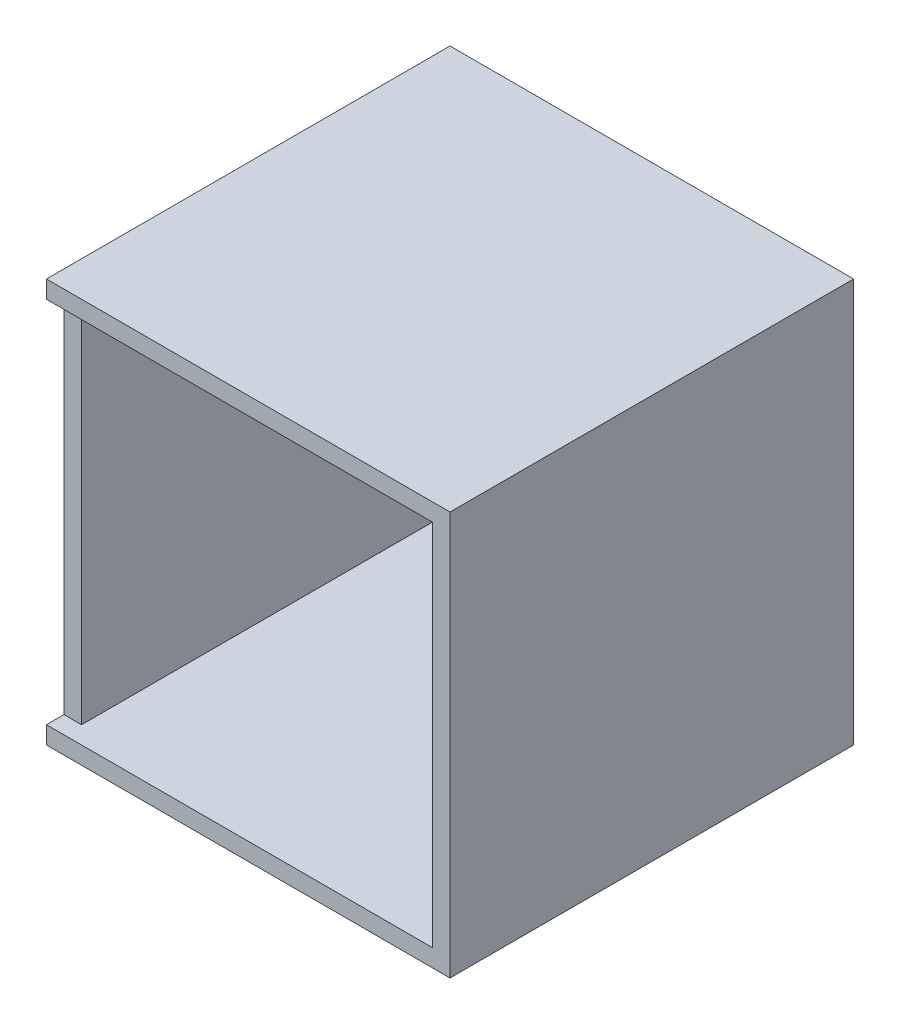
ISO-10303-21;
HEADER;
FILE_DESCRIPTION(('STEP AP214'),'2;1');
FILE_NAME('part.step','',(''),(''),'','','');
FILE_SCHEMA(('AUTOMOTIVE_DESIGN { 1 0 10303 214 1 1 1 1 }'));
ENDSEC;
DATA;
#1=APPLICATION_CONTEXT('core data for automotive mechanical design processes');
#2=APPLICATION_PROTOCOL_DEFINITION('international standard','automotive_design',2000,#1);
#3=PRODUCT_CONTEXT('',#1,'mechanical');
#4=PRODUCT('Part','Part','',(#3));
#5=PRODUCT_RELATED_PRODUCT_CATEGORY('part','',(#4));
#6=PRODUCT_DEFINITION_FORMATION('','',#4);
#7=PRODUCT_DEFINITION_CONTEXT('part definition',#1,'design');
#8=PRODUCT_DEFINITION('design','',#6,#7);
#9=PRODUCT_DEFINITION_SHAPE('','',#8);
#10=(LENGTH_UNIT() NAMED_UNIT(*) SI_UNIT(.MILLI.,.METRE.));
#11=(NAMED_UNIT(*) PLANE_ANGLE_UNIT() SI_UNIT($,.RADIAN.));
#12=(NAMED_UNIT(*) SI_UNIT($,.STERADIAN.) SOLID_ANGLE_UNIT());
#13=UNCERTAINTY_MEASURE_WITH_UNIT(LENGTH_MEASURE(1.E-05),#10,'distance_accuracy_value','');
#14=(GEOMETRIC_REPRESENTATION_CONTEXT(3) GLOBAL_UNCERTAINTY_ASSIGNED_CONTEXT((#13)) GLOBAL_UNIT_ASSIGNED_CONTEXT((#10,
#11,#12)) REPRESENTATION_CONTEXT('',''));
#15=CARTESIAN_POINT('',(0.,0.,0.));
#16=DIRECTION('',(0.,0.,1.));
#17=DIRECTION('',(1.,0.,0.));
#18=AXIS2_PLACEMENT_3D('',#15,#16,#17);
#19=CARTESIAN_POINT('',(146.05,146.05,146.05));
#20=DIRECTION('',(-1.,0.,0.));
#21=DIRECTION('',(0.,-1.,0.));
#22=AXIS2_PLACEMENT_3D('',#19,#20,#21);
#23=PLANE('',#22);
#24=DIRECTION('',(0.,1.,0.));
#25=VECTOR('',#24,1.);
#26=CARTESIAN_POINT('',(146.05,146.05,-146.05));
#27=LINE('',#26,#25);
#28=CARTESIAN_POINT('',(146.05,-146.05,-146.05));
#29=VERTEX_POINT('',#28);
#30=CARTESIAN_POINT('',(146.05,146.05,-146.05));
#31=VERTEX_POINT('',#30);
#32=EDGE_CURVE('E219',#29,#31,#27,.T.);
#33=ORIENTED_EDGE('',*,*,#32,.T.);
#34=DIRECTION('',(0.,0.,-1.));
#35=VECTOR('',#34,1.);
#36=CARTESIAN_POINT('',(146.05,146.05,146.05));
#37=LINE('',#36,#35);
#38=CARTESIAN_POINT('',(146.05,146.05,146.05));
#39=VERTEX_POINT('',#38);
#40=EDGE_CURVE('E11',#39,#31,#37,.T.);
#41=ORIENTED_EDGE('',*,*,#40,.F.);
#42=DIRECTION('',(0.,1.,0.));
#43=VECTOR('',#42,1.);
#44=CARTESIAN_POINT('',(146.05,146.05,146.05));
#45=LINE('',#44,#43);
#46=CARTESIAN_POINT('',(146.05,-146.05,146.05));
#47=VERTEX_POINT('',#46);
#48=EDGE_CURVE('E249',#47,#39,#45,.T.);
#49=ORIENTED_EDGE('',*,*,#48,.F.);
#50=DIRECTION('',(0.,0.,-1.));
#51=VECTOR('',#50,1.);
#52=CARTESIAN_POINT('',(146.05,-146.05,146.05));
#53=LINE('',#52,#51);
#54=EDGE_CURVE('E265',#47,#29,#53,.T.);
#55=ORIENTED_EDGE('',*,*,#54,.T.);
#56=EDGE_LOOP('',(#33,#41,#49,#55));
#57=FACE_BOUND('',#56,.T.);
#58=ADVANCED_FACE('F38',(#57),#23,.F.);
#59=CARTESIAN_POINT('',(-146.05,146.05,146.05));
#60=DIRECTION('',(0.,-1.,0.));
#61=DIRECTION('',(0.,0.,-1.));
#62=AXIS2_PLACEMENT_3D('',#59,#60,#61);
#63=PLANE('',#62);
#64=DIRECTION('',(-1.,0.,0.));
#65=VECTOR('',#64,1.);
#66=CARTESIAN_POINT('',(-146.05,146.05,-146.05));
#67=LINE('',#66,#65);
#68=CARTESIAN_POINT('',(-146.05,146.05,-146.05));
#69=VERTEX_POINT('',#68);
#70=EDGE_CURVE('E269',#31,#69,#67,.T.);
#71=ORIENTED_EDGE('',*,*,#70,.T.);
#72=DIRECTION('',(0.,0.,-1.));
#73=VECTOR('',#72,1.);
#74=CARTESIAN_POINT('',(-146.05,146.05,146.05));
#75=LINE('',#74,#73);
#76=CARTESIAN_POINT('',(-146.05,146.05,146.05));
#77=VERTEX_POINT('',#76);
#78=EDGE_CURVE('E46',#77,#69,#75,.T.);
#79=ORIENTED_EDGE('',*,*,#78,.F.);
#80=DIRECTION('',(-1.,0.,0.));
#81=VECTOR('',#80,1.);
#82=CARTESIAN_POINT('',(-146.05,146.05,146.05));
#83=LINE('',#82,#81);
#84=EDGE_CURVE('E253',#39,#77,#83,.T.);
#85=ORIENTED_EDGE('',*,*,#84,.F.);
#86=ORIENTED_EDGE('',*,*,#40,.T.);
#87=EDGE_LOOP('',(#71,#79,#85,#86));
#88=FACE_BOUND('',#87,.T.);
#89=ADVANCED_FACE('F340',(#88),#63,.F.);
#90=CARTESIAN_POINT('',(-146.05,146.05,146.05));
#91=DIRECTION('',(1.,0.,0.));
#92=DIRECTION('',(0.,1.,0.));
#93=AXIS2_PLACEMENT_3D('',#90,#91,#92);
#94=PLANE('',#93);
#95=DIRECTION('',(0.,1.,0.));
#96=VECTOR('',#95,1.);
#97=CARTESIAN_POINT('',(-146.05,146.05,133.35));
#98=LINE('',#97,#96);
#99=CARTESIAN_POINT('',(-146.05,-133.35,133.35));
#100=VERTEX_POINT('',#99);
#101=CARTESIAN_POINT('',(-146.05,133.35,133.35));
#102=VERTEX_POINT('',#101);
#103=EDGE_CURVE('E198',#100,#102,#98,.T.);
#104=ORIENTED_EDGE('',*,*,#103,.T.);
#105=DIRECTION('',(0.,0.,1.));
#106=VECTOR('',#105,1.);
#107=CARTESIAN_POINT('',(-146.05,133.35,146.05));
#108=LINE('',#107,#106);
#109=CARTESIAN_POINT('',(-146.05,133.35,146.05));
#110=VERTEX_POINT('',#109);
#111=EDGE_CURVE('E206',#102,#110,#108,.T.);
#112=ORIENTED_EDGE('',*,*,#111,.T.);
#113=DIRECTION('',(0.,-1.,0.));
#114=VECTOR('',#113,1.);
#115=CARTESIAN_POINT('',(-146.05,146.05,146.05));
#116=LINE('',#115,#114);
#117=EDGE_CURVE('E258',#77,#110,#116,.T.);
#118=ORIENTED_EDGE('',*,*,#117,.F.);
#119=ORIENTED_EDGE('',*,*,#78,.T.);
#120=DIRECTION('',(0.,-1.,0.));
#121=VECTOR('',#120,1.);
#122=CARTESIAN_POINT('',(-146.05,146.05,-146.05));
#123=LINE('',#122,#121);
#124=CARTESIAN_POINT('',(-146.05,-146.05,-146.05));
#125=VERTEX_POINT('',#124);
#126=EDGE_CURVE('E272',#69,#125,#123,.T.);
#127=ORIENTED_EDGE('',*,*,#126,.T.);
#128=DIRECTION('',(0.,0.,-1.));
#129=VECTOR('',#128,1.);
#130=CARTESIAN_POINT('',(-146.05,-146.05,146.05));
#131=LINE('',#130,#129);
#132=CARTESIAN_POINT('',(-146.05,-146.05,146.05));
#133=VERTEX_POINT('',#132);
#134=EDGE_CURVE('E280',#133,#125,#131,.T.);
#135=ORIENTED_EDGE('',*,*,#134,.F.);
#136=CARTESIAN_POINT('',(-146.05,-133.35,146.05));
#137=VERTEX_POINT('',#136);
#138=EDGE_CURVE('E257',#137,#133,#116,.T.);
#139=ORIENTED_EDGE('',*,*,#138,.F.);
#140=DIRECTION('',(0.,0.,-1.));
#141=VECTOR('',#140,1.);
#142=CARTESIAN_POINT('',(-146.05,-133.35,146.05));
#143=LINE('',#142,#141);
#144=EDGE_CURVE('E202',#137,#100,#143,.T.);
#145=ORIENTED_EDGE('',*,*,#144,.T.);
#146=EDGE_LOOP('',(#104,#112,#118,#119,#127,#135,#139,#145));
#147=FACE_BOUND('',#146,.T.);
#148=ADVANCED_FACE('F289',(#147),#94,.F.);
#149=CARTESIAN_POINT('',(-146.05,-146.05,146.05));
#150=DIRECTION('',(0.,1.,0.));
#151=DIRECTION('',(0.,0.,1.));
#152=AXIS2_PLACEMENT_3D('',#149,#150,#151);
#153=PLANE('',#152);
#154=DIRECTION('',(1.,0.,0.));
#155=VECTOR('',#154,1.);
#156=CARTESIAN_POINT('',(-146.05,-146.05,-146.05));
#157=LINE('',#156,#155);
#158=EDGE_CURVE('E254',#125,#29,#157,.T.);
#159=ORIENTED_EDGE('',*,*,#158,.T.);
#160=ORIENTED_EDGE('',*,*,#54,.F.);
#161=DIRECTION('',(1.,0.,0.));
#162=VECTOR('',#161,1.);
#163=CARTESIAN_POINT('',(-146.05,-146.05,146.05));
#164=LINE('',#163,#162);
#165=EDGE_CURVE('E262',#133,#47,#164,.T.);
#166=ORIENTED_EDGE('',*,*,#165,.F.);
#167=ORIENTED_EDGE('',*,*,#134,.T.);
#168=EDGE_LOOP('',(#159,#160,#166,#167));
#169=FACE_BOUND('',#168,.T.);
#170=ADVANCED_FACE('F298',(#169),#153,.F.);
#171=CARTESIAN_POINT('',(0.,0.,146.05));
#172=DIRECTION('',(0.,0.,1.));
#173=DIRECTION('',(1.,0.,0.));
#174=AXIS2_PLACEMENT_3D('',#171,#172,#173);
#175=PLANE('',#174);
#176=ORIENTED_EDGE('',*,*,#117,.T.);
#177=DIRECTION('',(-1.,0.,0.));
#178=VECTOR('',#177,1.);
#179=CARTESIAN_POINT('',(-146.05,133.35,146.05));
#180=LINE('',#179,#178);
#181=CARTESIAN_POINT('',(133.35,133.35,146.05));
#182=VERTEX_POINT('',#181);
#183=EDGE_CURVE('E244',#182,#110,#180,.T.);
#184=ORIENTED_EDGE('',*,*,#183,.F.);
#185=DIRECTION('',(0.,1.,0.));
#186=VECTOR('',#185,1.);
#187=CARTESIAN_POINT('',(133.35,146.05,146.05));
#188=LINE('',#187,#186);
#189=CARTESIAN_POINT('',(133.35,-133.35,146.05));
#190=VERTEX_POINT('',#189);
#191=EDGE_CURVE('E241',#190,#182,#188,.T.);
#192=ORIENTED_EDGE('',*,*,#191,.F.);
#193=DIRECTION('',(1.,0.,0.));
#194=VECTOR('',#193,1.);
#195=CARTESIAN_POINT('',(-146.05,-133.35,146.05));
#196=LINE('',#195,#194);
#197=EDGE_CURVE('E226',#137,#190,#196,.T.);
#198=ORIENTED_EDGE('',*,*,#197,.F.);
#199=ORIENTED_EDGE('',*,*,#138,.T.);
#200=ORIENTED_EDGE('',*,*,#165,.T.);
#201=ORIENTED_EDGE('',*,*,#48,.T.);
#202=ORIENTED_EDGE('',*,*,#84,.T.);
#203=EDGE_LOOP('',(#176,#184,#192,#198,#199,#200,#201,#202));
#204=FACE_BOUND('',#203,.T.);
#205=ADVANCED_FACE('F304',(#204),#175,.T.);
#206=CARTESIAN_POINT('',(0.,0.,-146.05));
#207=DIRECTION('',(0.,0.,1.));
#208=DIRECTION('',(1.,0.,0.));
#209=AXIS2_PLACEMENT_3D('',#206,#207,#208);
#210=PLANE('',#209);
#211=DIRECTION('',(1.,0.,0.));
#212=VECTOR('',#211,1.);
#213=CARTESIAN_POINT('',(95.25,-84.328,-146.05));
#214=LINE('',#213,#212);
#215=CARTESIAN_POINT('',(86.36,-84.328,-146.05));
#216=VERTEX_POINT('',#215);
#217=CARTESIAN_POINT('',(95.25,-84.328,-146.05));
#218=VERTEX_POINT('',#217);
#219=EDGE_CURVE('E175',#216,#218,#214,.T.);
#220=ORIENTED_EDGE('',*,*,#219,.F.);
#221=DIRECTION('',(0.,1.,0.));
#222=VECTOR('',#221,1.);
#223=CARTESIAN_POINT('',(86.36,-84.328,-146.05));
#224=LINE('',#223,#222);
#225=CARTESIAN_POINT('',(86.36,-95.25,-146.05));
#226=VERTEX_POINT('',#225);
#227=EDGE_CURVE('E53',#226,#216,#224,.T.);
#228=ORIENTED_EDGE('',*,*,#227,.F.);
#229=DIRECTION('',(-1.,0.,0.));
#230=VECTOR('',#229,1.);
#231=CARTESIAN_POINT('',(95.25,-95.25,-146.05));
#232=LINE('',#231,#230);
#233=CARTESIAN_POINT('',(95.25,-95.25,-146.05));
#234=VERTEX_POINT('',#233);
#235=EDGE_CURVE('E162',#234,#226,#232,.T.);
#236=ORIENTED_EDGE('',*,*,#235,.F.);
#237=DIRECTION('',(0.,-1.,0.));
#238=VECTOR('',#237,1.);
#239=CARTESIAN_POINT('',(95.25,-84.328,-146.05));
#240=LINE('',#239,#238);
#241=EDGE_CURVE('E166',#218,#234,#240,.T.);
#242=ORIENTED_EDGE('',*,*,#241,.F.);
#243=EDGE_LOOP('',(#220,#228,#236,#242));
#244=FACE_BOUND('',#243,.T.);
#245=ORIENTED_EDGE('',*,*,#32,.F.);
#246=ORIENTED_EDGE('',*,*,#158,.F.);
#247=ORIENTED_EDGE('',*,*,#126,.F.);
#248=ORIENTED_EDGE('',*,*,#70,.F.);
#249=EDGE_LOOP('',(#245,#246,#247,#248));
#250=FACE_BOUND('',#249,.T.);
#251=ADVANCED_FACE('F295',(#244,#250),#210,.F.);
#252=CARTESIAN_POINT('',(133.35,146.05,146.05));
#253=DIRECTION('',(-1.,0.,0.));
#254=DIRECTION('',(0.,-1.,0.));
#255=AXIS2_PLACEMENT_3D('',#252,#253,#254);
#256=PLANE('',#255);
#257=DIRECTION('',(0.,1.,0.));
#258=VECTOR('',#257,1.);
#259=CARTESIAN_POINT('',(133.35,146.05,-133.35));
#260=LINE('',#259,#258);
#261=CARTESIAN_POINT('',(133.35,-133.35,-133.35));
#262=VERTEX_POINT('',#261);
#263=CARTESIAN_POINT('',(133.35,133.35,-133.35));
#264=VERTEX_POINT('',#263);
#265=EDGE_CURVE('E210',#262,#264,#260,.T.);
#266=ORIENTED_EDGE('',*,*,#265,.F.);
#267=DIRECTION('',(0.,0.,-1.));
#268=VECTOR('',#267,1.);
#269=CARTESIAN_POINT('',(133.35,-133.35,146.05));
#270=LINE('',#269,#268);
#271=EDGE_CURVE('E221',#190,#262,#270,.T.);
#272=ORIENTED_EDGE('',*,*,#271,.F.);
#273=ORIENTED_EDGE('',*,*,#191,.T.);
#274=DIRECTION('',(0.,0.,-1.));
#275=VECTOR('',#274,1.);
#276=CARTESIAN_POINT('',(133.35,133.35,146.05));
#277=LINE('',#276,#275);
#278=EDGE_CURVE('E215',#182,#264,#277,.T.);
#279=ORIENTED_EDGE('',*,*,#278,.T.);
#280=EDGE_LOOP('',(#266,#272,#273,#279));
#281=FACE_BOUND('',#280,.T.);
#282=ADVANCED_FACE('F327',(#281),#256,.T.);
#283=CARTESIAN_POINT('',(-146.05,133.35,146.05));
#284=DIRECTION('',(0.,-1.,0.));
#285=DIRECTION('',(0.,0.,-1.));
#286=AXIS2_PLACEMENT_3D('',#283,#284,#285);
#287=PLANE('',#286);
#288=ORIENTED_EDGE('',*,*,#183,.T.);
#289=ORIENTED_EDGE('',*,*,#111,.F.);
#290=DIRECTION('',(-1.,0.,0.));
#291=VECTOR('',#290,1.);
#292=CARTESIAN_POINT('',(-111.289341478824,133.35,133.35));
#293=LINE('',#292,#291);
#294=CARTESIAN_POINT('',(-133.35,133.35,133.35));
#295=VERTEX_POINT('',#294);
#296=EDGE_CURVE('E191',#295,#102,#293,.T.);
#297=ORIENTED_EDGE('',*,*,#296,.F.);
#298=DIRECTION('',(0.,0.,-1.));
#299=VECTOR('',#298,1.);
#300=CARTESIAN_POINT('',(-133.35,133.35,146.05));
#301=LINE('',#300,#299);
#302=CARTESIAN_POINT('',(-133.35,133.35,-133.35));
#303=VERTEX_POINT('',#302);
#304=EDGE_CURVE('E220',#295,#303,#301,.T.);
#305=ORIENTED_EDGE('',*,*,#304,.T.);
#306=DIRECTION('',(-1.,0.,0.));
#307=VECTOR('',#306,1.);
#308=CARTESIAN_POINT('',(-146.05,133.35,-133.35));
#309=LINE('',#308,#307);
#310=EDGE_CURVE('E214',#264,#303,#309,.T.);
#311=ORIENTED_EDGE('',*,*,#310,.F.);
#312=ORIENTED_EDGE('',*,*,#278,.F.);
#313=EDGE_LOOP('',(#288,#289,#297,#305,#311,#312));
#314=FACE_BOUND('',#313,.T.);
#315=ADVANCED_FACE('F323',(#314),#287,.T.);
#316=CARTESIAN_POINT('',(-133.35,146.05,146.05));
#317=DIRECTION('',(1.,0.,0.));
#318=DIRECTION('',(0.,1.,0.));
#319=AXIS2_PLACEMENT_3D('',#316,#317,#318);
#320=PLANE('',#319);
#321=DIRECTION('',(0.,1.,0.));
#322=VECTOR('',#321,1.);
#323=CARTESIAN_POINT('',(-133.35,146.05,133.35));
#324=LINE('',#323,#322);
#325=CARTESIAN_POINT('',(-133.35,-133.35,133.35));
#326=VERTEX_POINT('',#325);
#327=EDGE_CURVE('E195',#326,#295,#324,.T.);
#328=ORIENTED_EDGE('',*,*,#327,.F.);
#329=DIRECTION('',(0.,0.,-1.));
#330=VECTOR('',#329,1.);
#331=CARTESIAN_POINT('',(-133.35,-133.35,146.05));
#332=LINE('',#331,#330);
#333=CARTESIAN_POINT('',(-133.35,-133.35,-133.35));
#334=VERTEX_POINT('',#333);
#335=EDGE_CURVE('E225',#326,#334,#332,.T.);
#336=ORIENTED_EDGE('',*,*,#335,.T.);
#337=DIRECTION('',(0.,-1.,0.));
#338=VECTOR('',#337,1.);
#339=CARTESIAN_POINT('',(-133.35,146.05,-133.35));
#340=LINE('',#339,#338);
#341=EDGE_CURVE('E230',#303,#334,#340,.T.);
#342=ORIENTED_EDGE('',*,*,#341,.F.);
#343=ORIENTED_EDGE('',*,*,#304,.F.);
#344=EDGE_LOOP('',(#328,#336,#342,#343));
#345=FACE_BOUND('',#344,.T.);
#346=ADVANCED_FACE('F316',(#345),#320,.T.);
#347=CARTESIAN_POINT('',(-146.05,-133.35,146.05));
#348=DIRECTION('',(0.,1.,0.));
#349=DIRECTION('',(0.,0.,1.));
#350=AXIS2_PLACEMENT_3D('',#347,#348,#349);
#351=PLANE('',#350);
#352=ORIENTED_EDGE('',*,*,#197,.T.);
#353=ORIENTED_EDGE('',*,*,#271,.T.);
#354=DIRECTION('',(1.,0.,0.));
#355=VECTOR('',#354,1.);
#356=CARTESIAN_POINT('',(-146.05,-133.35,-133.35));
#357=LINE('',#356,#355);
#358=EDGE_CURVE('E236',#334,#262,#357,.T.);
#359=ORIENTED_EDGE('',*,*,#358,.F.);
#360=ORIENTED_EDGE('',*,*,#335,.F.);
#361=DIRECTION('',(1.,0.,0.));
#362=VECTOR('',#361,1.);
#363=CARTESIAN_POINT('',(-111.289341478824,-133.35,133.35));
#364=LINE('',#363,#362);
#365=EDGE_CURVE('E61',#100,#326,#364,.T.);
#366=ORIENTED_EDGE('',*,*,#365,.F.);
#367=ORIENTED_EDGE('',*,*,#144,.F.);
#368=EDGE_LOOP('',(#352,#353,#359,#360,#366,#367));
#369=FACE_BOUND('',#368,.T.);
#370=ADVANCED_FACE('F310',(#369),#351,.T.);
#371=CARTESIAN_POINT('',(0.,0.,-133.35));
#372=DIRECTION('',(0.,0.,1.));
#373=DIRECTION('',(1.,0.,0.));
#374=AXIS2_PLACEMENT_3D('',#371,#372,#373);
#375=PLANE('',#374);
#376=ORIENTED_EDGE('',*,*,#265,.T.);
#377=ORIENTED_EDGE('',*,*,#310,.T.);
#378=ORIENTED_EDGE('',*,*,#341,.T.);
#379=ORIENTED_EDGE('',*,*,#358,.T.);
#380=EDGE_LOOP('',(#376,#377,#378,#379));
#381=FACE_BOUND('',#380,.T.);
#382=ADVANCED_FACE('F319',(#381),#375,.T.);
#383=CARTESIAN_POINT('',(0.,0.,133.35));
#384=DIRECTION('',(0.,0.,-1.));
#385=DIRECTION('',(-1.,0.,0.));
#386=AXIS2_PLACEMENT_3D('',#383,#384,#385);
#387=PLANE('',#386);
#388=ORIENTED_EDGE('',*,*,#365,.T.);
#389=ORIENTED_EDGE('',*,*,#327,.T.);
#390=ORIENTED_EDGE('',*,*,#296,.T.);
#391=ORIENTED_EDGE('',*,*,#103,.F.);
#392=EDGE_LOOP('',(#388,#389,#390,#391));
#393=FACE_BOUND('',#392,.T.);
#394=ADVANCED_FACE('F328',(#393),#387,.F.);
#395=CARTESIAN_POINT('',(86.36,-84.328,-143.51));
#396=DIRECTION('',(-1.,0.,0.));
#397=DIRECTION('',(0.,-1.,0.));
#398=AXIS2_PLACEMENT_3D('',#395,#396,#397);
#399=PLANE('',#398);
#400=ORIENTED_EDGE('',*,*,#227,.T.);
#401=DIRECTION('',(0.,0.,-1.));
#402=VECTOR('',#401,1.);
#403=CARTESIAN_POINT('',(86.36,-84.328,-143.51));
#404=LINE('',#403,#402);
#405=CARTESIAN_POINT('',(86.36,-84.328,-143.51));
#406=VERTEX_POINT('',#405);
#407=EDGE_CURVE('E137',#406,#216,#404,.T.);
#408=ORIENTED_EDGE('',*,*,#407,.F.);
#409=DIRECTION('',(0.,1.,0.));
#410=VECTOR('',#409,1.);
#411=CARTESIAN_POINT('',(86.36,-84.328,-143.51));
#412=LINE('',#411,#410);
#413=CARTESIAN_POINT('',(86.36,-95.25,-143.51));
#414=VERTEX_POINT('',#413);
#415=EDGE_CURVE('E141',#414,#406,#412,.T.);
#416=ORIENTED_EDGE('',*,*,#415,.F.);
#417=DIRECTION('',(0.,0.,-1.));
#418=VECTOR('',#417,1.);
#419=CARTESIAN_POINT('',(86.36,-95.25,-143.51));
#420=LINE('',#419,#418);
#421=EDGE_CURVE('E181',#414,#226,#420,.T.);
#422=ORIENTED_EDGE('',*,*,#421,.T.);
#423=EDGE_LOOP('',(#400,#408,#416,#422));
#424=FACE_BOUND('',#423,.T.);
#425=ADVANCED_FACE('F139',(#424),#399,.F.);
#426=CARTESIAN_POINT('',(95.25,-95.25,-143.51));
#427=DIRECTION('',(0.,-1.,0.));
#428=DIRECTION('',(0.,0.,-1.));
#429=AXIS2_PLACEMENT_3D('',#426,#427,#428);
#430=PLANE('',#429);
#431=ORIENTED_EDGE('',*,*,#235,.T.);
#432=ORIENTED_EDGE('',*,*,#421,.F.);
#433=DIRECTION('',(-1.,0.,0.));
#434=VECTOR('',#433,1.);
#435=CARTESIAN_POINT('',(95.25,-95.25,-143.51));
#436=LINE('',#435,#434);
#437=CARTESIAN_POINT('',(95.25,-95.25,-143.51));
#438=VERTEX_POINT('',#437);
#439=EDGE_CURVE('E148',#438,#414,#436,.T.);
#440=ORIENTED_EDGE('',*,*,#439,.F.);
#441=DIRECTION('',(0.,0.,-1.));
#442=VECTOR('',#441,1.);
#443=CARTESIAN_POINT('',(95.25,-95.25,-143.51));
#444=LINE('',#443,#442);
#445=EDGE_CURVE('E184',#438,#234,#444,.T.);
#446=ORIENTED_EDGE('',*,*,#445,.T.);
#447=EDGE_LOOP('',(#431,#432,#440,#446));
#448=FACE_BOUND('',#447,.T.);
#449=ADVANCED_FACE('F335',(#448),#430,.F.);
#450=CARTESIAN_POINT('',(95.25,-84.328,-143.51));
#451=DIRECTION('',(1.,0.,0.));
#452=DIRECTION('',(0.,0.,-1.));
#453=AXIS2_PLACEMENT_3D('',#450,#451,#452);
#454=PLANE('',#453);
#455=ORIENTED_EDGE('',*,*,#241,.T.);
#456=ORIENTED_EDGE('',*,*,#445,.F.);
#457=DIRECTION('',(0.,-1.,0.));
#458=VECTOR('',#457,1.);
#459=CARTESIAN_POINT('',(95.25,-84.328,-143.51));
#460=LINE('',#459,#458);
#461=CARTESIAN_POINT('',(95.25,-84.328,-143.51));
#462=VERTEX_POINT('',#461);
#463=EDGE_CURVE('E157',#462,#438,#460,.T.);
#464=ORIENTED_EDGE('',*,*,#463,.F.);
#465=DIRECTION('',(0.,0.,-1.));
#466=VECTOR('',#465,1.);
#467=CARTESIAN_POINT('',(95.25,-84.328,-143.51));
#468=LINE('',#467,#466);
#469=EDGE_CURVE('E147',#462,#218,#468,.T.);
#470=ORIENTED_EDGE('',*,*,#469,.T.);
#471=EDGE_LOOP('',(#455,#456,#464,#470));
#472=FACE_BOUND('',#471,.T.);
#473=ADVANCED_FACE('F444',(#472),#454,.F.);
#474=CARTESIAN_POINT('',(95.25,-84.328,-143.51));
#475=DIRECTION('',(0.,1.,0.));
#476=DIRECTION('',(0.,0.,1.));
#477=AXIS2_PLACEMENT_3D('',#474,#475,#476);
#478=PLANE('',#477);
#479=ORIENTED_EDGE('',*,*,#219,.T.);
#480=ORIENTED_EDGE('',*,*,#469,.F.);
#481=DIRECTION('',(1.,0.,0.));
#482=VECTOR('',#481,1.);
#483=CARTESIAN_POINT('',(95.25,-84.328,-143.51));
#484=LINE('',#483,#482);
#485=EDGE_CURVE('E151',#406,#462,#484,.T.);
#486=ORIENTED_EDGE('',*,*,#485,.F.);
#487=ORIENTED_EDGE('',*,*,#407,.T.);
#488=EDGE_LOOP('',(#479,#480,#486,#487));
#489=FACE_BOUND('',#488,.T.);
#490=ADVANCED_FACE('F152',(#489),#478,.F.);
#491=CARTESIAN_POINT('',(0.,0.,-143.51));
#492=DIRECTION('',(0.,0.,-1.));
#493=DIRECTION('',(-1.,0.,0.));
#494=AXIS2_PLACEMENT_3D('',#491,#492,#493);
#495=PLANE('',#494);
#496=ORIENTED_EDGE('',*,*,#415,.T.);
#497=ORIENTED_EDGE('',*,*,#485,.T.);
#498=ORIENTED_EDGE('',*,*,#463,.T.);
#499=ORIENTED_EDGE('',*,*,#439,.T.);
#500=EDGE_LOOP('',(#496,#497,#498,#499));
#501=FACE_BOUND('',#500,.T.);
#502=ADVANCED_FACE('F159',(#501),#495,.T.);
#503=CLOSED_SHELL('',(#58,#89,#148,#170,#205,#251,#282,#315,#346,#370,#382,#394,#425,#449,#473,
#490,#502));
#504=MANIFOLD_SOLID_BREP('B2',#503);
#505=ADVANCED_BREP_SHAPE_REPRESENTATION('',(#18,#504),#14);
#506=SHAPE_DEFINITION_REPRESENTATION(#9,#505);
ENDSEC;
END-ISO-10303-21;
